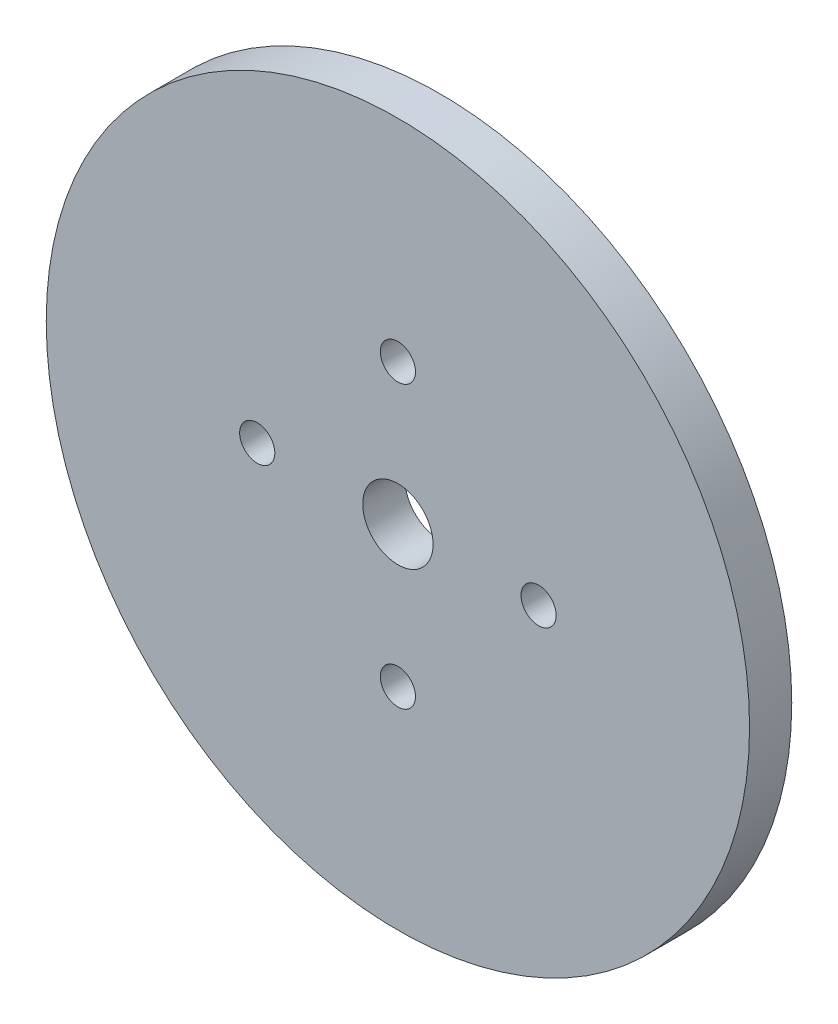
ISO-10303-21;
HEADER;
FILE_DESCRIPTION(('STEP AP214'),'2;1');
FILE_NAME('part.step','',(''),(''),'','','');
FILE_SCHEMA(('AUTOMOTIVE_DESIGN { 1 0 10303 214 1 1 1 1 }'));
ENDSEC;
DATA;
#1=APPLICATION_CONTEXT('core data for automotive mechanical design processes');
#2=APPLICATION_PROTOCOL_DEFINITION('international standard','automotive_design',2000,#1);
#3=PRODUCT_CONTEXT('',#1,'mechanical');
#4=PRODUCT('Part','Part','',(#3));
#5=PRODUCT_RELATED_PRODUCT_CATEGORY('part','',(#4));
#6=PRODUCT_DEFINITION_FORMATION('','',#4);
#7=PRODUCT_DEFINITION_CONTEXT('part definition',#1,'design');
#8=PRODUCT_DEFINITION('design','',#6,#7);
#9=PRODUCT_DEFINITION_SHAPE('','',#8);
#10=(LENGTH_UNIT() NAMED_UNIT(*) SI_UNIT(.MILLI.,.METRE.));
#11=(NAMED_UNIT(*) PLANE_ANGLE_UNIT() SI_UNIT($,.RADIAN.));
#12=(NAMED_UNIT(*) SI_UNIT($,.STERADIAN.) SOLID_ANGLE_UNIT());
#13=UNCERTAINTY_MEASURE_WITH_UNIT(LENGTH_MEASURE(1.E-05),#10,'distance_accuracy_value','');
#14=(GEOMETRIC_REPRESENTATION_CONTEXT(3) GLOBAL_UNCERTAINTY_ASSIGNED_CONTEXT((#13)) GLOBAL_UNIT_ASSIGNED_CONTEXT((#10,
#11,#12)) REPRESENTATION_CONTEXT('',''));
#15=CARTESIAN_POINT('',(0.,0.,0.));
#16=DIRECTION('',(0.,0.,1.));
#17=DIRECTION('',(1.,0.,0.));
#18=AXIS2_PLACEMENT_3D('',#15,#16,#17);
#19=CARTESIAN_POINT('',(0.,0.,6.));
#20=DIRECTION('',(0.,0.,1.));
#21=DIRECTION('',(1.,0.,0.));
#22=AXIS2_PLACEMENT_3D('',#19,#20,#21);
#23=PLANE('',#22);
#24=CARTESIAN_POINT('',(20.,1.37043154602168E-13,6.));
#25=DIRECTION('',(0.,0.,-1.));
#26=DIRECTION('',(-1.,0.,0.));
#27=AXIS2_PLACEMENT_3D('',#24,#25,#26);
#28=CIRCLE('',#27,2.50000000000007);
#29=CARTESIAN_POINT('',(17.4999999999999,1.37043154602168E-13,6.));
#30=VERTEX_POINT('',#29);
#31=EDGE_CURVE('E66',#30,#30,#28,.T.);
#32=ORIENTED_EDGE('',*,*,#31,.T.);
#33=EDGE_LOOP('',(#32));
#34=FACE_BOUND('',#33,.T.);
#35=CARTESIAN_POINT('',(0.,-19.9999999999999,6.));
#36=DIRECTION('',(0.,0.,-1.));
#37=DIRECTION('',(-1.,0.,0.));
#38=AXIS2_PLACEMENT_3D('',#35,#36,#37);
#39=CIRCLE('',#38,2.50000000000017);
#40=CARTESIAN_POINT('',(-2.50000000000017,-19.9999999999999,6.));
#41=VERTEX_POINT('',#40);
#42=EDGE_CURVE('E60',#41,#41,#39,.T.);
#43=ORIENTED_EDGE('',*,*,#42,.T.);
#44=EDGE_LOOP('',(#43));
#45=FACE_BOUND('',#44,.T.);
#46=CARTESIAN_POINT('',(-20.,1.4153275490778E-13,6.));
#47=DIRECTION('',(0.,0.,-1.));
#48=DIRECTION('',(-1.,0.,0.));
#49=AXIS2_PLACEMENT_3D('',#46,#47,#48);
#50=CIRCLE('',#49,2.5000000000002);
#51=CARTESIAN_POINT('',(-22.5000000000002,1.4153275490778E-13,6.));
#52=VERTEX_POINT('',#51);
#53=EDGE_CURVE('E54',#52,#52,#50,.T.);
#54=ORIENTED_EDGE('',*,*,#53,.T.);
#55=EDGE_LOOP('',(#54));
#56=FACE_BOUND('',#55,.T.);
#57=CARTESIAN_POINT('',(0.,20.,6.));
#58=DIRECTION('',(0.,0.,-1.));
#59=DIRECTION('',(-1.,0.,0.));
#60=AXIS2_PLACEMENT_3D('',#57,#58,#59);
#61=CIRCLE('',#60,2.5);
#62=CARTESIAN_POINT('',(-2.5,20.,6.));
#63=VERTEX_POINT('',#62);
#64=EDGE_CURVE('E48',#63,#63,#61,.T.);
#65=ORIENTED_EDGE('',*,*,#64,.T.);
#66=EDGE_LOOP('',(#65));
#67=FACE_BOUND('',#66,.T.);
#68=CARTESIAN_POINT('',(0.,0.,6.));
#69=DIRECTION('',(0.,0.,1.));
#70=DIRECTION('',(1.,0.,0.));
#71=AXIS2_PLACEMENT_3D('',#68,#69,#70);
#72=CIRCLE('',#71,50.);
#73=CARTESIAN_POINT('',(50.,0.,6.));
#74=VERTEX_POINT('',#73);
#75=EDGE_CURVE('E10',#74,#74,#72,.T.);
#76=ORIENTED_EDGE('',*,*,#75,.T.);
#77=EDGE_LOOP('',(#76));
#78=FACE_BOUND('',#77,.T.);
#79=CARTESIAN_POINT('',(0.,0.,6.));
#80=DIRECTION('',(0.,0.,1.));
#81=DIRECTION('',(1.,0.,0.));
#82=AXIS2_PLACEMENT_3D('',#79,#80,#81);
#83=CIRCLE('',#82,5.);
#84=CARTESIAN_POINT('',(5.,0.,6.));
#85=VERTEX_POINT('',#84);
#86=EDGE_CURVE('E43',#85,#85,#83,.T.);
#87=ORIENTED_EDGE('',*,*,#86,.F.);
#88=EDGE_LOOP('',(#87));
#89=FACE_BOUND('',#88,.T.);
#90=ADVANCED_FACE('F32',(#34,#45,#56,#67,#78,#89),#23,.T.);
#91=CARTESIAN_POINT('',(0.,0.,0.));
#92=DIRECTION('',(0.,0.,1.));
#93=DIRECTION('',(1.,0.,0.));
#94=AXIS2_PLACEMENT_3D('',#91,#92,#93);
#95=PLANE('',#94);
#96=CARTESIAN_POINT('',(20.,1.37043154602168E-13,0.));
#97=DIRECTION('',(0.,0.,-1.));
#98=DIRECTION('',(-1.,0.,0.));
#99=AXIS2_PLACEMENT_3D('',#96,#97,#98);
#100=CIRCLE('',#99,2.50000000000007);
#101=CARTESIAN_POINT('',(17.4999999999999,1.37043154602168E-13,0.));
#102=VERTEX_POINT('',#101);
#103=EDGE_CURVE('E69',#102,#102,#100,.T.);
#104=ORIENTED_EDGE('',*,*,#103,.F.);
#105=EDGE_LOOP('',(#104));
#106=FACE_BOUND('',#105,.T.);
#107=CARTESIAN_POINT('',(0.,-19.9999999999999,0.));
#108=DIRECTION('',(0.,0.,-1.));
#109=DIRECTION('',(-1.,0.,0.));
#110=AXIS2_PLACEMENT_3D('',#107,#108,#109);
#111=CIRCLE('',#110,2.50000000000017);
#112=CARTESIAN_POINT('',(-2.50000000000017,-19.9999999999999,0.));
#113=VERTEX_POINT('',#112);
#114=EDGE_CURVE('E63',#113,#113,#111,.T.);
#115=ORIENTED_EDGE('',*,*,#114,.F.);
#116=EDGE_LOOP('',(#115));
#117=FACE_BOUND('',#116,.T.);
#118=CARTESIAN_POINT('',(-20.,1.4153275490778E-13,0.));
#119=DIRECTION('',(0.,0.,-1.));
#120=DIRECTION('',(-1.,0.,0.));
#121=AXIS2_PLACEMENT_3D('',#118,#119,#120);
#122=CIRCLE('',#121,2.5000000000002);
#123=CARTESIAN_POINT('',(-22.5000000000002,1.4153275490778E-13,0.));
#124=VERTEX_POINT('',#123);
#125=EDGE_CURVE('E57',#124,#124,#122,.T.);
#126=ORIENTED_EDGE('',*,*,#125,.F.);
#127=EDGE_LOOP('',(#126));
#128=FACE_BOUND('',#127,.T.);
#129=CARTESIAN_POINT('',(0.,20.,0.));
#130=DIRECTION('',(0.,0.,-1.));
#131=DIRECTION('',(-1.,0.,0.));
#132=AXIS2_PLACEMENT_3D('',#129,#130,#131);
#133=CIRCLE('',#132,2.5);
#134=CARTESIAN_POINT('',(-2.5,20.,0.));
#135=VERTEX_POINT('',#134);
#136=EDGE_CURVE('E51',#135,#135,#133,.T.);
#137=ORIENTED_EDGE('',*,*,#136,.F.);
#138=EDGE_LOOP('',(#137));
#139=FACE_BOUND('',#138,.T.);
#140=CARTESIAN_POINT('',(0.,0.,0.));
#141=DIRECTION('',(0.,0.,1.));
#142=DIRECTION('',(1.,0.,0.));
#143=AXIS2_PLACEMENT_3D('',#140,#141,#142);
#144=CIRCLE('',#143,50.);
#145=CARTESIAN_POINT('',(50.,0.,0.));
#146=VERTEX_POINT('',#145);
#147=EDGE_CURVE('E36',#146,#146,#144,.T.);
#148=ORIENTED_EDGE('',*,*,#147,.F.);
#149=EDGE_LOOP('',(#148));
#150=FACE_BOUND('',#149,.T.);
#151=CARTESIAN_POINT('',(0.,0.,0.));
#152=DIRECTION('',(0.,0.,1.));
#153=DIRECTION('',(1.,0.,0.));
#154=AXIS2_PLACEMENT_3D('',#151,#152,#153);
#155=CIRCLE('',#154,5.);
#156=CARTESIAN_POINT('',(5.,0.,0.));
#157=VERTEX_POINT('',#156);
#158=EDGE_CURVE('E45',#157,#157,#155,.T.);
#159=ORIENTED_EDGE('',*,*,#158,.T.);
#160=EDGE_LOOP('',(#159));
#161=FACE_BOUND('',#160,.T.);
#162=ADVANCED_FACE('F84',(#106,#117,#128,#139,#150,#161),#95,.F.);
#163=CARTESIAN_POINT('',(0.,0.,6.));
#164=DIRECTION('',(0.,0.,-1.));
#165=DIRECTION('',(-1.,0.,0.));
#166=AXIS2_PLACEMENT_3D('',#163,#164,#165);
#167=CYLINDRICAL_SURFACE('',#166,50.);
#168=ORIENTED_EDGE('',*,*,#75,.F.);
#169=EDGE_LOOP('',(#168));
#170=FACE_BOUND('',#169,.T.);
#171=ORIENTED_EDGE('',*,*,#147,.T.);
#172=EDGE_LOOP('',(#171));
#173=FACE_BOUND('',#172,.T.);
#174=ADVANCED_FACE('F34',(#170,#173),#167,.T.);
#175=CARTESIAN_POINT('',(0.,0.,6.));
#176=DIRECTION('',(0.,0.,-1.));
#177=DIRECTION('',(-1.,0.,0.));
#178=AXIS2_PLACEMENT_3D('',#175,#176,#177);
#179=CYLINDRICAL_SURFACE('',#178,5.);
#180=ORIENTED_EDGE('',*,*,#86,.T.);
#181=EDGE_LOOP('',(#180));
#182=FACE_BOUND('',#181,.T.);
#183=ORIENTED_EDGE('',*,*,#158,.F.);
#184=EDGE_LOOP('',(#183));
#185=FACE_BOUND('',#184,.T.);
#186=ADVANCED_FACE('F97',(#182,#185),#179,.F.);
#187=CARTESIAN_POINT('',(0.,20.,6.));
#188=DIRECTION('',(0.,0.,-1.));
#189=DIRECTION('',(-1.,0.,0.));
#190=AXIS2_PLACEMENT_3D('',#187,#188,#189);
#191=CYLINDRICAL_SURFACE('',#190,2.5);
#192=ORIENTED_EDGE('',*,*,#64,.F.);
#193=EDGE_LOOP('',(#192));
#194=FACE_BOUND('',#193,.T.);
#195=ORIENTED_EDGE('',*,*,#136,.T.);
#196=EDGE_LOOP('',(#195));
#197=FACE_BOUND('',#196,.T.);
#198=ADVANCED_FACE('F99',(#194,#197),#191,.F.);
#199=CARTESIAN_POINT('',(-20.,1.4153275490778E-13,6.));
#200=DIRECTION('',(0.,0.,-1.));
#201=DIRECTION('',(-1.,0.,0.));
#202=AXIS2_PLACEMENT_3D('',#199,#200,#201);
#203=CYLINDRICAL_SURFACE('',#202,2.5000000000002);
#204=ORIENTED_EDGE('',*,*,#53,.F.);
#205=EDGE_LOOP('',(#204));
#206=FACE_BOUND('',#205,.T.);
#207=ORIENTED_EDGE('',*,*,#125,.T.);
#208=EDGE_LOOP('',(#207));
#209=FACE_BOUND('',#208,.T.);
#210=ADVANCED_FACE('F106',(#206,#209),#203,.F.);
#211=CARTESIAN_POINT('',(0.,-19.9999999999999,6.));
#212=DIRECTION('',(0.,0.,-1.));
#213=DIRECTION('',(-1.,0.,0.));
#214=AXIS2_PLACEMENT_3D('',#211,#212,#213);
#215=CYLINDRICAL_SURFACE('',#214,2.50000000000017);
#216=ORIENTED_EDGE('',*,*,#42,.F.);
#217=EDGE_LOOP('',(#216));
#218=FACE_BOUND('',#217,.T.);
#219=ORIENTED_EDGE('',*,*,#114,.T.);
#220=EDGE_LOOP('',(#219));
#221=FACE_BOUND('',#220,.T.);
#222=ADVANCED_FACE('F80',(#218,#221),#215,.F.);
#223=CARTESIAN_POINT('',(20.,1.37043154602168E-13,6.));
#224=DIRECTION('',(0.,0.,-1.));
#225=DIRECTION('',(-1.,0.,0.));
#226=AXIS2_PLACEMENT_3D('',#223,#224,#225);
#227=CYLINDRICAL_SURFACE('',#226,2.50000000000007);
#228=ORIENTED_EDGE('',*,*,#31,.F.);
#229=EDGE_LOOP('',(#228));
#230=FACE_BOUND('',#229,.T.);
#231=ORIENTED_EDGE('',*,*,#103,.T.);
#232=EDGE_LOOP('',(#231));
#233=FACE_BOUND('',#232,.T.);
#234=ADVANCED_FACE('F77',(#230,#233),#227,.F.);
#235=CLOSED_SHELL('',(#90,#162,#174,#186,#198,#210,#222,#234));
#236=MANIFOLD_SOLID_BREP('B2',#235);
#237=ADVANCED_BREP_SHAPE_REPRESENTATION('',(#18,#236),#14);
#238=SHAPE_DEFINITION_REPRESENTATION(#9,#237);
ENDSEC;
END-ISO-10303-21;
